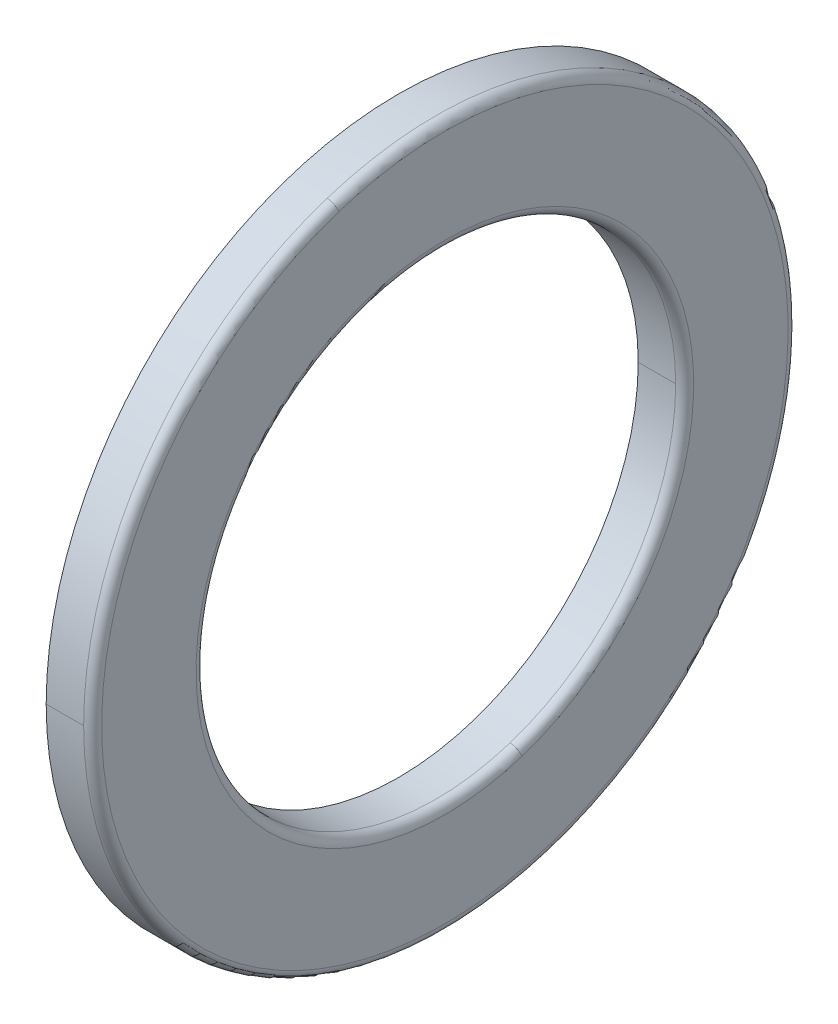
ISO-10303-21;
HEADER;
FILE_DESCRIPTION(('STEP AP214'),'2;1');
FILE_NAME('part.step','',(''),(''),'','','');
FILE_SCHEMA(('AUTOMOTIVE_DESIGN { 1 0 10303 214 1 1 1 1 }'));
ENDSEC;
DATA;
#1=APPLICATION_CONTEXT('core data for automotive mechanical design processes');
#2=APPLICATION_PROTOCOL_DEFINITION('international standard','automotive_design',2000,#1);
#3=PRODUCT_CONTEXT('',#1,'mechanical');
#4=PRODUCT('Part','Part','',(#3));
#5=PRODUCT_RELATED_PRODUCT_CATEGORY('part','',(#4));
#6=PRODUCT_DEFINITION_FORMATION('','',#4);
#7=PRODUCT_DEFINITION_CONTEXT('part definition',#1,'design');
#8=PRODUCT_DEFINITION('design','',#6,#7);
#9=PRODUCT_DEFINITION_SHAPE('','',#8);
#10=(LENGTH_UNIT() NAMED_UNIT(*) SI_UNIT(.MILLI.,.METRE.));
#11=(NAMED_UNIT(*) PLANE_ANGLE_UNIT() SI_UNIT($,.RADIAN.));
#12=(NAMED_UNIT(*) SI_UNIT($,.STERADIAN.) SOLID_ANGLE_UNIT());
#13=UNCERTAINTY_MEASURE_WITH_UNIT(LENGTH_MEASURE(1.E-05),#10,'distance_accuracy_value','');
#14=(GEOMETRIC_REPRESENTATION_CONTEXT(3) GLOBAL_UNCERTAINTY_ASSIGNED_CONTEXT((#13)) GLOBAL_UNIT_ASSIGNED_CONTEXT((#10,
#11,#12)) REPRESENTATION_CONTEXT('',''));
#15=CARTESIAN_POINT('',(0.,0.,0.));
#16=DIRECTION('',(0.,0.,1.));
#17=DIRECTION('',(1.,0.,0.));
#18=AXIS2_PLACEMENT_3D('',#15,#16,#17);
#19=CARTESIAN_POINT('',(5.5,0.,0.));
#20=DIRECTION('',(1.,0.,0.));
#21=DIRECTION('',(0.,-0.309016994374947,0.951056516295154));
#22=AXIS2_PLACEMENT_3D('',#19,#20,#21);
#23=TOROIDAL_SURFACE('',#22,19.25,3.);
#24=CARTESIAN_POINT('',(5.5,-18.3078379386817,-5.94857714171773));
#25=DIRECTION('',(0.,0.309016994374947,-0.951056516295154));
#26=DIRECTION('',(0.800000000000001,0.570633909777091,0.185410196624968));
#27=AXIS2_PLACEMENT_3D('',#24,#25,#26);
#28=CIRCLE('',#27,3.);
#29=CARTESIAN_POINT('',(7.9,-16.5959362093504,-5.39234655184283));
#30=VERTEX_POINT('',#29);
#31=CARTESIAN_POINT('',(7.9,-20.019739668013,-6.50480773159264));
#32=VERTEX_POINT('',#31);
#33=EDGE_CURVE('E11',#30,#32,#28,.T.);
#34=ORIENTED_EDGE('',*,*,#33,.F.);
#35=CARTESIAN_POINT('',(7.9,0.,0.));
#36=DIRECTION('',(1.,0.,0.));
#37=DIRECTION('',(0.,-0.951056516295154,-0.309016994374947));
#38=AXIS2_PLACEMENT_3D('',#35,#36,#37);
#39=CIRCLE('',#38,17.45);
#40=CARTESIAN_POINT('',(7.9,16.5959362093504,5.39234655184283));
#41=VERTEX_POINT('',#40);
#42=EDGE_CURVE('E25',#30,#41,#39,.T.);
#43=ORIENTED_EDGE('',*,*,#42,.T.);
#44=CARTESIAN_POINT('',(5.5,18.3078379386817,5.94857714171774));
#45=DIRECTION('',(0.,-0.309016994374947,0.951056516295154));
#46=DIRECTION('',(0.8,-0.570633909777092,-0.185410196624968));
#47=AXIS2_PLACEMENT_3D('',#44,#45,#46);
#48=CIRCLE('',#47,3.);
#49=CARTESIAN_POINT('',(7.9,20.019739668013,6.50480773159264));
#50=VERTEX_POINT('',#49);
#51=EDGE_CURVE('E327',#41,#50,#48,.T.);
#52=ORIENTED_EDGE('',*,*,#51,.T.);
#53=CARTESIAN_POINT('',(7.9,0.,0.));
#54=DIRECTION('',(1.,0.,0.));
#55=DIRECTION('',(0.,-0.951056516295154,-0.309016994374947));
#56=AXIS2_PLACEMENT_3D('',#53,#54,#55);
#57=CIRCLE('',#56,21.05);
#58=EDGE_CURVE('E323',#32,#50,#57,.T.);
#59=ORIENTED_EDGE('',*,*,#58,.F.);
#60=EDGE_LOOP('',(#34,#43,#52,#59));
#61=FACE_BOUND('',#60,.T.);
#62=ADVANCED_FACE('F17',(#61),#23,.F.);
#63=CARTESIAN_POINT('',(7.9,23.5,0.));
#64=DIRECTION('',(-1.,0.,0.));
#65=DIRECTION('',(0.,0.,1.));
#66=AXIS2_PLACEMENT_3D('',#63,#64,#65);
#67=PLANE('',#66);
#68=ORIENTED_EDGE('',*,*,#58,.T.);
#69=CARTESIAN_POINT('',(7.9,0.,0.));
#70=DIRECTION('',(1.,0.,0.));
#71=DIRECTION('',(0.,0.,-1.));
#72=AXIS2_PLACEMENT_3D('',#69,#70,#71);
#73=CIRCLE('',#72,21.05);
#74=EDGE_CURVE('E318',#50,#32,#73,.T.);
#75=ORIENTED_EDGE('',*,*,#74,.T.);
#76=EDGE_LOOP('',(#68,#75));
#77=FACE_BOUND('',#76,.T.);
#78=CARTESIAN_POINT('',(7.9,0.,0.));
#79=DIRECTION('',(1.,0.,0.));
#80=DIRECTION('',(0.,0.,-1.));
#81=AXIS2_PLACEMENT_3D('',#78,#79,#80);
#82=CIRCLE('',#81,23.5);
#83=CARTESIAN_POINT('',(7.9,0.,23.5));
#84=VERTEX_POINT('',#83);
#85=CARTESIAN_POINT('',(7.9,0.,-23.5));
#86=VERTEX_POINT('',#85);
#87=EDGE_CURVE('E313',#84,#86,#82,.T.);
#88=ORIENTED_EDGE('',*,*,#87,.F.);
#89=CARTESIAN_POINT('',(7.9,0.,0.));
#90=DIRECTION('',(1.,0.,0.));
#91=DIRECTION('',(0.,0.,-1.));
#92=AXIS2_PLACEMENT_3D('',#89,#90,#91);
#93=CIRCLE('',#92,23.5);
#94=EDGE_CURVE('E308',#86,#84,#93,.T.);
#95=ORIENTED_EDGE('',*,*,#94,.F.);
#96=EDGE_LOOP('',(#88,#95));
#97=FACE_BOUND('',#96,.T.);
#98=ADVANCED_FACE('F233',(#77,#97),#67,.T.);
#99=CARTESIAN_POINT('',(10.4,0.,0.));
#100=DIRECTION('',(1.,0.,0.));
#101=DIRECTION('',(0.,-1.,0.));
#102=AXIS2_PLACEMENT_3D('',#99,#100,#101);
#103=CYLINDRICAL_SURFACE('',#102,23.5);
#104=DIRECTION('',(1.,0.,0.));
#105=VECTOR('',#104,1.);
#106=CARTESIAN_POINT('',(7.9,0.,23.5));
#107=LINE('',#106,#105);
#108=CARTESIAN_POINT('',(10.4,0.,23.5));
#109=VERTEX_POINT('',#108);
#110=EDGE_CURVE('E304',#84,#109,#107,.T.);
#111=ORIENTED_EDGE('',*,*,#110,.T.);
#112=CARTESIAN_POINT('',(10.4,0.,0.));
#113=DIRECTION('',(1.,0.,0.));
#114=DIRECTION('',(0.,0.,-1.));
#115=AXIS2_PLACEMENT_3D('',#112,#113,#114);
#116=CIRCLE('',#115,23.5);
#117=CARTESIAN_POINT('',(10.4,22.3498281329361,7.26189936781126));
#118=VERTEX_POINT('',#117);
#119=EDGE_CURVE('E300',#118,#109,#116,.T.);
#120=ORIENTED_EDGE('',*,*,#119,.F.);
#121=CARTESIAN_POINT('',(10.4,0.,0.));
#122=DIRECTION('',(1.,0.,0.));
#123=DIRECTION('',(0.,0.,-1.));
#124=AXIS2_PLACEMENT_3D('',#121,#122,#123);
#125=CIRCLE('',#124,23.5);
#126=CARTESIAN_POINT('',(10.4,0.,-23.5));
#127=VERTEX_POINT('',#126);
#128=EDGE_CURVE('E296',#127,#118,#125,.T.);
#129=ORIENTED_EDGE('',*,*,#128,.F.);
#130=DIRECTION('',(1.,0.,0.));
#131=VECTOR('',#130,1.);
#132=CARTESIAN_POINT('',(7.9,0.,-23.5));
#133=LINE('',#132,#131);
#134=EDGE_CURVE('E291',#86,#127,#133,.T.);
#135=ORIENTED_EDGE('',*,*,#134,.F.);
#136=ORIENTED_EDGE('',*,*,#94,.T.);
#137=EDGE_LOOP('',(#111,#120,#129,#135,#136));
#138=FACE_BOUND('',#137,.T.);
#139=ADVANCED_FACE('F237',(#138),#103,.T.);
#140=CARTESIAN_POINT('',(10.4,0.,0.));
#141=DIRECTION('',(1.,0.,0.));
#142=DIRECTION('',(0.,1.,0.));
#143=AXIS2_PLACEMENT_3D('',#140,#141,#142);
#144=CYLINDRICAL_SURFACE('',#143,23.5);
#145=ORIENTED_EDGE('',*,*,#110,.F.);
#146=ORIENTED_EDGE('',*,*,#87,.T.);
#147=ORIENTED_EDGE('',*,*,#134,.T.);
#148=CARTESIAN_POINT('',(10.4,0.,0.));
#149=DIRECTION('',(1.,0.,0.));
#150=DIRECTION('',(0.,0.,-1.));
#151=AXIS2_PLACEMENT_3D('',#148,#149,#150);
#152=CIRCLE('',#151,23.5);
#153=CARTESIAN_POINT('',(10.4,-22.3498281329361,-7.26189936781126));
#154=VERTEX_POINT('',#153);
#155=EDGE_CURVE('E287',#154,#127,#152,.T.);
#156=ORIENTED_EDGE('',*,*,#155,.F.);
#157=CARTESIAN_POINT('',(10.4,0.,0.));
#158=DIRECTION('',(1.,0.,0.));
#159=DIRECTION('',(0.,0.,-1.));
#160=AXIS2_PLACEMENT_3D('',#157,#158,#159);
#161=CIRCLE('',#160,23.5);
#162=EDGE_CURVE('E266',#109,#154,#161,.T.);
#163=ORIENTED_EDGE('',*,*,#162,.F.);
#164=EDGE_LOOP('',(#145,#146,#147,#156,#163));
#165=FACE_BOUND('',#164,.T.);
#166=ADVANCED_FACE('F242',(#165),#144,.T.);
#167=CARTESIAN_POINT('',(10.4000000000002,0.,0.));
#168=DIRECTION('',(1.,0.,0.));
#169=DIRECTION('',(0.,0.309016994374947,-0.951056516295154));
#170=AXIS2_PLACEMENT_3D('',#167,#168,#169);
#171=TOROIDAL_SURFACE('',#170,22.9000000000003,0.599999999999748);
#172=CARTESIAN_POINT('',(10.4000000000002,-21.7791942231593,-7.07648917118637));
#173=DIRECTION('',(0.,0.309016994374947,-0.951056516295154));
#174=DIRECTION('',(1.,0.,0.));
#175=AXIS2_PLACEMENT_3D('',#172,#173,#174);
#176=CIRCLE('',#175,0.599999999999747);
#177=CARTESIAN_POINT('',(11.,-21.7791942231593,-7.07648917118637));
#178=VERTEX_POINT('',#177);
#179=EDGE_CURVE('E259',#178,#154,#176,.T.);
#180=ORIENTED_EDGE('',*,*,#179,.F.);
#181=CARTESIAN_POINT('',(11.,0.,0.));
#182=DIRECTION('',(1.,0.,0.));
#183=DIRECTION('',(0.,0.,-1.));
#184=AXIS2_PLACEMENT_3D('',#181,#182,#183);
#185=CIRCLE('',#184,22.9);
#186=CARTESIAN_POINT('',(11.,21.7791942231593,7.07648917118637));
#187=VERTEX_POINT('',#186);
#188=EDGE_CURVE('E262',#187,#178,#185,.T.);
#189=ORIENTED_EDGE('',*,*,#188,.F.);
#190=CARTESIAN_POINT('',(10.4000000000002,21.7791942231593,7.07648917118637));
#191=DIRECTION('',(0.,-0.309016994374947,0.951056516295154));
#192=DIRECTION('',(1.,0.,0.));
#193=AXIS2_PLACEMENT_3D('',#190,#191,#192);
#194=CIRCLE('',#193,0.599999999999747);
#195=EDGE_CURVE('E271',#187,#118,#194,.T.);
#196=ORIENTED_EDGE('',*,*,#195,.T.);
#197=ORIENTED_EDGE('',*,*,#119,.T.);
#198=ORIENTED_EDGE('',*,*,#162,.T.);
#199=EDGE_LOOP('',(#180,#189,#196,#197,#198));
#200=FACE_BOUND('',#199,.T.);
#201=ADVANCED_FACE('F249',(#200),#171,.T.);
#202=CARTESIAN_POINT('',(10.4000000000002,0.,0.));
#203=DIRECTION('',(1.,0.,0.));
#204=DIRECTION('',(0.,-0.309016994374947,0.951056516295154));
#205=AXIS2_PLACEMENT_3D('',#202,#203,#204);
#206=TOROIDAL_SURFACE('',#205,22.9000000000003,0.599999999999748);
#207=ORIENTED_EDGE('',*,*,#179,.T.);
#208=ORIENTED_EDGE('',*,*,#155,.T.);
#209=ORIENTED_EDGE('',*,*,#128,.T.);
#210=ORIENTED_EDGE('',*,*,#195,.F.);
#211=CARTESIAN_POINT('',(11.,-21.779194223159,-7.07648917118629));
#212=CARTESIAN_POINT('',(11.,-20.6675767557073,-10.497524989855));
#213=CARTESIAN_POINT('',(11.,-18.8845171401787,-13.7005026982399));
#214=CARTESIAN_POINT('',(11.,-16.4859366746272,-16.5087282472489));
#215=CARTESIAN_POINT('',(11.,-10.716969966334,-21.0332298184904));
#216=CARTESIAN_POINT('',(11.,-3.66565316884742,-23.0410097314247));
#217=CARTESIAN_POINT('',(11.,0.016116955726321,-23.3307776027427));
#218=CARTESIAN_POINT('',(11.,7.29469581034565,-22.4507652042022));
#219=CARTESIAN_POINT('',(11.,13.7004481083275,-18.884468881489));
#220=CARTESIAN_POINT('',(11.,16.5087414271407,-16.4859515676135));
#221=CARTESIAN_POINT('',(11.,21.0332331263571,-10.7169634742802));
#222=CARTESIAN_POINT('',(11.,23.0409899357996,-3.66565125996869));
#223=CARTESIAN_POINT('',(11.,23.3308487319883,0.0161011573056626));
#224=CARTESIAN_POINT('',(11.,22.8907112025243,3.65542070195902));
#225=CARTESIAN_POINT('',(11.,21.779194223159,7.07648917118629));
#226=B_SPLINE_CURVE_WITH_KNOTS('',5,(#211,#212,#213,#214,#215,#216,#217,#218,#219,#220,#221,
#222,#223,#224,#225),.UNSPECIFIED.,.F.,.F.,(6,3,3,3,6),(0.,0.785398163397448,1.5707963267949,
2.35619449019234,3.14159265358979),.UNSPECIFIED.);
#227=EDGE_CURVE('E205',#178,#187,#226,.T.);
#228=ORIENTED_EDGE('',*,*,#227,.F.);
#229=EDGE_LOOP('',(#207,#208,#209,#210,#228));
#230=FACE_BOUND('',#229,.T.);
#231=ADVANCED_FACE('F167',(#230),#206,.T.);
#232=CARTESIAN_POINT('',(11.,16.6,0.));
#233=DIRECTION('',(1.,0.,0.));
#234=DIRECTION('',(0.,0.,-1.));
#235=AXIS2_PLACEMENT_3D('',#232,#233,#234);
#236=PLANE('',#235);
#237=ORIENTED_EDGE('',*,*,#227,.T.);
#238=ORIENTED_EDGE('',*,*,#188,.T.);
#239=EDGE_LOOP('',(#237,#238));
#240=FACE_BOUND('',#239,.T.);
#241=CARTESIAN_POINT('',(11.,15.7875381704993,5.12968210662408));
#242=CARTESIAN_POINT('',(11.,15.7036093382217,5.38800713718692));
#243=CARTESIAN_POINT('',(11.,15.6133296931235,5.64426814808535));
#244=CARTESIAN_POINT('',(11.,15.4203099435753,6.15205377442434));
#245=CARTESIAN_POINT('',(11.,15.3175698391254,6.40357838986492));
#246=CARTESIAN_POINT('',(11.,15.0998703371631,6.90128286915921));
#247=CARTESIAN_POINT('',(11.,14.9849109396507,7.14746273301294));
#248=CARTESIAN_POINT('',(11.,14.7430514985896,7.63388528638444));
#249=CARTESIAN_POINT('',(11.,14.6161514550409,7.87412797590221));
#250=CARTESIAN_POINT('',(11.,14.3507159797756,8.34809724179649));
#251=CARTESIAN_POINT('',(11.,14.212180548059,8.58182381817299));
#252=CARTESIAN_POINT('',(11.,13.9238081624852,9.0421978363785));
#253=CARTESIAN_POINT('',(11.,13.7739712086279,9.26884527820751));
#254=CARTESIAN_POINT('',(11.,13.4633567164187,9.71451500134898));
#255=CARTESIAN_POINT('',(11.,13.3025791780668,9.93353728266144));
#256=CARTESIAN_POINT('',(11.,12.9704708528027,10.3634290442406));
#257=CARTESIAN_POINT('',(11.,12.7991400658904,10.5742985245073));
#258=CARTESIAN_POINT('',(11.,12.4463379920302,10.9873766800545));
#259=CARTESIAN_POINT('',(11.,12.2648667050823,11.1895853553351));
#260=CARTESIAN_POINT('',(11.,11.8922208120052,11.584854762739));
#261=CARTESIAN_POINT('',(11.,11.701046205876,11.7779154948624));
#262=CARTESIAN_POINT('',(11.,11.3094542306388,12.1544239156742));
#263=CARTESIAN_POINT('',(11.,11.1090368615308,12.3378716043625));
#264=CARTESIAN_POINT('',(11.,10.6994421833778,12.6947119967712));
#265=CARTESIAN_POINT('',(11.,10.4902648743329,12.8681047004915));
#266=CARTESIAN_POINT('',(11.,10.0636542427532,13.2044174047489));
#267=CARTESIAN_POINT('',(11.,9.84622092021852,13.3673374052859));
#268=CARTESIAN_POINT('',(11.,9.40362207758142,13.6823122146264));
#269=CARTESIAN_POINT('',(11.,9.17845655747904,13.8343670234299));
#270=CARTESIAN_POINT('',(11.,8.72093576316587,14.1272451359504));
#271=CARTESIAN_POINT('',(11.,8.48858048895507,14.2680684396673));
#272=CARTESIAN_POINT('',(11.,8.01723995063278,14.5381442863412));
#273=CARTESIAN_POINT('',(11.,7.77825468652128,14.6673968292982));
#274=CARTESIAN_POINT('',(11.,7.29422990483141,14.9140197737552));
#275=CARTESIAN_POINT('',(11.,7.04919038725304,15.0313901752551));
#276=CARTESIAN_POINT('',(11.,6.55364742029021,15.2539660812203));
#277=CARTESIAN_POINT('',(11.,6.30314397090575,15.3591715856856));
#278=CARTESIAN_POINT('',(11.,5.79727662508181,15.5571642483062));
#279=CARTESIAN_POINT('',(11.,5.54191272864233,15.6499514064616));
#280=CARTESIAN_POINT('',(11.,5.02693968270213,15.8228838440713));
#281=CARTESIAN_POINT('',(11.,4.7673305332014,15.9030291235256));
#282=CARTESIAN_POINT('',(11.,4.2444924023189,16.050484726735));
#283=CARTESIAN_POINT('',(11.,3.98126342093714,16.1177950504902));
#284=CARTESIAN_POINT('',(11.,3.45181976796486,16.2394185858357));
#285=CARTESIAN_POINT('',(11.,3.18560509637435,16.293731797426));
#286=CARTESIAN_POINT('',(11.,2.65083139744609,16.3892302631579));
#287=CARTESIAN_POINT('',(11.,2.38227237010834,16.4304155172995));
#288=CARTESIAN_POINT('',(11.,1.84345694190547,16.4995588492492));
#289=CARTESIAN_POINT('',(11.,1.57320054104034,16.5275169270574));
#290=CARTESIAN_POINT('',(11.,1.03164143712404,16.570138552882));
#291=CARTESIAN_POINT('',(11.,0.76033873407287,16.5848021008985));
#292=CARTESIAN_POINT('',(11.,0.217340617759459,16.6007993413682));
#293=CARTESIAN_POINT('',(11.,-0.0543547955027848,16.6021330338214));
#294=CARTESIAN_POINT('',(11.,-0.597483794190092,16.5914673501827));
#295=CARTESIAN_POINT('',(11.,-0.868917379615156,16.5794679740907));
#296=CARTESIAN_POINT('',(11.,-1.41086881534604,16.5421650609097));
#297=CARTESIAN_POINT('',(11.,-1.68138666565186,16.5168615238206));
#298=CARTESIAN_POINT('',(11.,-2.22085492994831,16.4530112470825));
#299=CARTESIAN_POINT('',(11.,-2.48980534393893,16.4144645074334));
#300=CARTESIAN_POINT('',(11.,-3.02549081050041,16.3242206880474));
#301=CARTESIAN_POINT('',(11.,-3.29222586307127,16.2725236083105));
#302=CARTESIAN_POINT('',(11.,-3.82283801868833,16.156103651542));
#303=CARTESIAN_POINT('',(11.,-4.08671512173454,16.0913807745104));
#304=CARTESIAN_POINT('',(11.,-4.61097567524816,15.9490651462325));
#305=CARTESIAN_POINT('',(11.,-4.87135912571557,15.8714723949861));
#306=CARTESIAN_POINT('',(11.,-5.38800508753254,15.7036039460125));
#307=CARTESIAN_POINT('',(11.,-5.6442675988821,15.6133282482854));
#308=CARTESIAN_POINT('',(11.,-6.15205432362756,15.4203113884134));
#309=CARTESIAN_POINT('',(11.,-6.40357853702346,15.3175702262686));
#310=CARTESIAN_POINT('',(11.,-6.90128272200063,15.0998699500199));
#311=CARTESIAN_POINT('',(11.,-7.1474626935819,14.984910835916));
#312=CARTESIAN_POINT('',(11.,-7.63388532581543,14.7430516023243));
#313=CARTESIAN_POINT('',(11.,-7.8741279864677,14.6161514828365));
#314=CARTESIAN_POINT('',(11.,-8.34809723123096,14.3507159519799));
#315=CARTESIAN_POINT('',(11.,-8.58182381534194,14.2121805406112));
#316=CARTESIAN_POINT('',(11.,-9.04219783920949,13.923808169933));
#317=CARTESIAN_POINT('',(11.,-9.26884527896605,13.7739712106235));
#318=CARTESIAN_POINT('',(11.,-9.71451500059039,13.4633567144231));
#319=CARTESIAN_POINT('',(11.,-9.93353728245817,13.3025791775321));
#320=CARTESIAN_POINT('',(11.,-10.3634290444438,12.9704708533374));
#321=CARTESIAN_POINT('',(11.,-10.5742985245617,12.7991400660337));
#322=CARTESIAN_POINT('',(11.,-10.98737668,12.446337991887));
#323=CARTESIAN_POINT('',(11.,-11.1895853553205,12.2648667050439));
#324=CARTESIAN_POINT('',(11.,-11.5848547627536,11.8922208120436));
#325=CARTESIAN_POINT('',(11.,-11.7779154948663,11.7010462058863));
#326=CARTESIAN_POINT('',(11.,-12.1544239156702,11.3094542306285));
#327=CARTESIAN_POINT('',(11.,-12.3378716043615,11.109036861528));
#328=CARTESIAN_POINT('',(11.,-12.6947119967722,10.6994421833806));
#329=CARTESIAN_POINT('',(11.,-12.8681047004918,10.4902648743337));
#330=CARTESIAN_POINT('',(11.,-13.2044174047486,10.0636542427525));
#331=CARTESIAN_POINT('',(11.,-13.3673374052858,9.84622092021834));
#332=CARTESIAN_POINT('',(11.,-13.6823122146265,9.40362207758164));
#333=CARTESIAN_POINT('',(11.,-13.8343670234299,9.17845655747911));
#334=CARTESIAN_POINT('',(11.,-14.1272451359503,8.72093576316583));
#335=CARTESIAN_POINT('',(11.,-14.2680684396673,8.48858048895507));
#336=CARTESIAN_POINT('',(11.,-14.5381442863412,8.01723995063281));
#337=CARTESIAN_POINT('',(11.,-14.6673968292982,7.7782546865213));
#338=CARTESIAN_POINT('',(11.,-14.9140197737552,7.29422990483143));
#339=CARTESIAN_POINT('',(11.,-15.0313901752551,7.04919038725306));
#340=CARTESIAN_POINT('',(11.,-15.2539660812204,6.55364742029023));
#341=CARTESIAN_POINT('',(11.,-15.3591715856856,6.30314397090576));
#342=CARTESIAN_POINT('',(11.,-15.5571642483062,5.79727662508185));
#343=CARTESIAN_POINT('',(11.,-15.6499514064614,5.54191272864242));
#344=CARTESIAN_POINT('',(11.,-15.8228838440715,5.0269396827021));
#345=CARTESIAN_POINT('',(11.,-15.9030291235263,4.76733053320121));
#346=CARTESIAN_POINT('',(11.,-16.0504847267343,4.24449240231913));
#347=CARTESIAN_POINT('',(11.,-16.1177950504873,3.98126342093793));
#348=CARTESIAN_POINT('',(11.,-16.2394185858385,3.45181976796411));
#349=CARTESIAN_POINT('',(11.,-16.2937317974366,3.18560509637149));
#350=CARTESIAN_POINT('',(11.,-16.3892302631473,2.650831397449));
#351=CARTESIAN_POINT('',(11.,-16.4304155172598,2.38227237011913));
#352=CARTESIAN_POINT('',(11.,-16.4995588492888,1.84345694189474));
#353=CARTESIAN_POINT('',(11.,-16.5275169272053,1.57320054100021));
#354=CARTESIAN_POINT('',(11.,-16.5701385527341,1.03164143716422));
#355=CARTESIAN_POINT('',(11.,-16.5848021003464,0.760338734222767));
#356=CARTESIAN_POINT('',(11.,-16.6007993419202,0.217340617609622));
#357=CARTESIAN_POINT('',(11.,-16.6021330358818,-0.0543547960620649));
#358=CARTESIAN_POINT('',(11.,-16.5914673481223,-0.597483793630752));
#359=CARTESIAN_POINT('',(11.,-16.5794679664013,-0.868917377527752));
#360=CARTESIAN_POINT('',(11.,-16.5421650685991,-1.41086881743339));
#361=CARTESIAN_POINT('',(11.,-16.516861552518,-1.68138667344203));
#362=CARTESIAN_POINT('',(11.,-16.4530112183851,-2.22085492215811));
#363=CARTESIAN_POINT('',(11.,-16.4144644003333,-2.48980531486555));
#364=CARTESIAN_POINT('',(11.,-16.3242207951475,-3.02549083957376));
#365=CARTESIAN_POINT('',(11.,-16.2725240080135,-3.29222597157453));
#366=CARTESIAN_POINT('',(11.,-16.1561032518389,-3.82283791018502));
#367=CARTESIAN_POINT('',(11.,-16.0913792827983,-4.08671471679474));
#368=CARTESIAN_POINT('',(11.,-15.9490666379446,-4.6109760801879));
#369=CARTESIAN_POINT('',(11.,-15.8714779621315,-4.87136063697134));
#370=CARTESIAN_POINT('',(11.,-15.7875381704993,-5.12968210662403));
#371=B_SPLINE_CURVE_WITH_KNOTS('',3,(#241,#242,#243,#244,#245,#246,#247,#248,#249,#250,#251,
#252,#253,#254,#255,#256,#257,#258,#259,#260,#261,#262,#263,#264,#265,#266,#267,#268,#269,#270,
#271,#272,#273,#274,#275,#276,#277,#278,#279,#280,#281,#282,#283,#284,#285,#286,#287,#288,#289,
#290,#291,#292,#293,#294,#295,#296,#297,#298,#299,#300,#301,#302,#303,#304,#305,#306,#307,#308,
#309,#310,#311,#312,#313,#314,#315,#316,#317,#318,#319,#320,#321,#322,#323,#324,#325,#326,#327,
#328,#329,#330,#331,#332,#333,#334,#335,#336,#337,#338,#339,#340,#341,#342,#343,#344,#345,#346,
#347,#348,#349,#350,#351,#352,#353,#354,#355,#356,#357,#358,#359,#360,#361,#362,#363,#364,#365,
#366,#367,#368,#369,#370),.UNSPECIFIED.,.F.,.F.,(4,2,2,2,2,2,2,2,2,2,2,2,2,2,2,2,2,2,2,2,2,2,2,
2,2,2,2,2,2,2,2,2,2,2,2,2,2,2,2,2,2,2,2,2,2,2,2,2,2,2,2,2,2,2,2,2,2,2,2,2,2,2,2,2,4),(0.,
0.814768786960672,1.62953757392135,2.44430636088202,3.2590751478427,4.07384393480337,
4.88861272176405,5.70338150872472,6.5181502956854,7.33291908264607,8.14768786960675,
8.96245665656743,9.7772254435281,10.5919942304888,11.4067630174494,12.2215318044101,
13.0363005913708,13.8510693783315,14.6658381652922,15.4806069522528,16.2953757392135,
17.1101445261742,17.9249133131349,18.7396821000955,19.5544508870562,20.3692196740169,
21.1839884609776,21.9987572479382,22.8135260348989,23.6282948218596,24.4430636088203,
25.2578323957809,26.0726011827416,26.8873699697023,27.702138756663,28.5169075436236,
29.3316763305843,30.146445117545,30.9612139045057,31.7759826914663,32.590751478427,
33.4055202653877,34.2202890523483,35.035057839309,35.8498266262697,36.6645954132304,
37.479364200191,38.2941329871517,39.1089017741124,39.9236705610731,40.7384393480338,
41.5532081349944,42.3679769219551,43.1827457089158,43.9975144958765,44.8122832828371,
45.6270520697978,46.4418208567585,47.2565896437191,48.0713584306798,48.8861272176405,
49.7008960046012,50.5156647915618,51.3304335785225,52.1452023654832),.UNSPECIFIED.);
#372=CARTESIAN_POINT('',(11.,15.7875381704993,5.12968210662405));
#373=VERTEX_POINT('',#372);
#374=CARTESIAN_POINT('',(11.,-15.7875381704993,-5.12968210662405));
#375=VERTEX_POINT('',#374);
#376=EDGE_CURVE('E201',#373,#375,#371,.T.);
#377=ORIENTED_EDGE('',*,*,#376,.F.);
#378=CARTESIAN_POINT('',(11.,-15.7875381704993,-5.12968210662408));
#379=CARTESIAN_POINT('',(11.,-15.7036093382217,-5.38800713718692));
#380=CARTESIAN_POINT('',(11.,-15.6133296931235,-5.64426814808535));
#381=CARTESIAN_POINT('',(11.,-15.4203099435753,-6.15205377442434));
#382=CARTESIAN_POINT('',(11.,-15.3175698391254,-6.40357838986492));
#383=CARTESIAN_POINT('',(11.,-15.0998703371631,-6.90128286915921));
#384=CARTESIAN_POINT('',(11.,-14.9849109396507,-7.14746273301293));
#385=CARTESIAN_POINT('',(11.,-14.7430514985896,-7.63388528638443));
#386=CARTESIAN_POINT('',(11.,-14.6161514550409,-7.87412797590221));
#387=CARTESIAN_POINT('',(11.,-14.3507159797756,-8.34809724179649));
#388=CARTESIAN_POINT('',(11.,-14.212180548059,-8.58182381817299));
#389=CARTESIAN_POINT('',(11.,-13.9238081624852,-9.04219783637849));
#390=CARTESIAN_POINT('',(11.,-13.7739712086279,-9.2688452782075));
#391=CARTESIAN_POINT('',(11.,-13.4633567164187,-9.71451500134897));
#392=CARTESIAN_POINT('',(11.,-13.3025791780668,-9.93353728266144));
#393=CARTESIAN_POINT('',(11.,-12.9704708528027,-10.3634290442406));
#394=CARTESIAN_POINT('',(11.,-12.7991400658904,-10.5742985245073));
#395=CARTESIAN_POINT('',(11.,-12.4463379920302,-10.9873766800545));
#396=CARTESIAN_POINT('',(11.,-12.2648667050823,-11.1895853553351));
#397=CARTESIAN_POINT('',(11.,-11.8922208120052,-11.584854762739));
#398=CARTESIAN_POINT('',(11.,-11.701046205876,-11.7779154948624));
#399=CARTESIAN_POINT('',(11.,-11.3094542306388,-12.1544239156742));
#400=CARTESIAN_POINT('',(11.,-11.1090368615308,-12.3378716043625));
#401=CARTESIAN_POINT('',(11.,-10.6994421833778,-12.6947119967712));
#402=CARTESIAN_POINT('',(11.,-10.4902648743329,-12.8681047004915));
#403=CARTESIAN_POINT('',(11.,-10.0636542427532,-13.2044174047488));
#404=CARTESIAN_POINT('',(11.,-9.84622092021852,-13.3673374052859));
#405=CARTESIAN_POINT('',(11.,-9.40362207758142,-13.6823122146264));
#406=CARTESIAN_POINT('',(11.,-9.17845655747905,-13.8343670234299));
#407=CARTESIAN_POINT('',(11.,-8.72093576316587,-14.1272451359504));
#408=CARTESIAN_POINT('',(11.,-8.48858048895508,-14.2680684396673));
#409=CARTESIAN_POINT('',(11.,-8.01723995063278,-14.5381442863412));
#410=CARTESIAN_POINT('',(11.,-7.77825468652129,-14.6673968292982));
#411=CARTESIAN_POINT('',(11.,-7.29422990483142,-14.9140197737552));
#412=CARTESIAN_POINT('',(11.,-7.04919038725305,-15.0313901752551));
#413=CARTESIAN_POINT('',(11.,-6.55364742029022,-15.2539660812203));
#414=CARTESIAN_POINT('',(11.,-6.30314397090576,-15.3591715856856));
#415=CARTESIAN_POINT('',(11.,-5.79727662508182,-15.5571642483062));
#416=CARTESIAN_POINT('',(11.,-5.54191272864235,-15.6499514064616));
#417=CARTESIAN_POINT('',(11.,-5.02693968270214,-15.8228838440713));
#418=CARTESIAN_POINT('',(11.,-4.76733053320141,-15.9030291235256));
#419=CARTESIAN_POINT('',(11.,-4.24449240231892,-16.050484726735));
#420=CARTESIAN_POINT('',(11.,-3.98126342093716,-16.1177950504902));
#421=CARTESIAN_POINT('',(11.,-3.45181976796488,-16.2394185858356));
#422=CARTESIAN_POINT('',(11.,-3.18560509637438,-16.293731797426));
#423=CARTESIAN_POINT('',(11.,-2.65083139744612,-16.3892302631579));
#424=CARTESIAN_POINT('',(11.,-2.38227237010837,-16.4304155172995));
#425=CARTESIAN_POINT('',(11.,-1.8434569419055,-16.4995588492492));
#426=CARTESIAN_POINT('',(11.,-1.57320054104036,-16.5275169270574));
#427=CARTESIAN_POINT('',(11.,-1.03164143712406,-16.570138552882));
#428=CARTESIAN_POINT('',(11.,-0.760338734072889,-16.5848021008985));
#429=CARTESIAN_POINT('',(11.,-0.217340617759477,-16.6007993413682));
#430=CARTESIAN_POINT('',(11.,0.0543547955027643,-16.6021330338214));
#431=CARTESIAN_POINT('',(11.,0.597483794190072,-16.5914673501827));
#432=CARTESIAN_POINT('',(11.,0.868917379615138,-16.5794679740907));
#433=CARTESIAN_POINT('',(11.,1.41086881534602,-16.5421650609097));
#434=CARTESIAN_POINT('',(11.,1.68138666565184,-16.5168615238206));
#435=CARTESIAN_POINT('',(11.,2.22085492994828,-16.4530112470825));
#436=CARTESIAN_POINT('',(11.,2.48980534393891,-16.4144645074334));
#437=CARTESIAN_POINT('',(11.,3.02549081050039,-16.3242206880474));
#438=CARTESIAN_POINT('',(11.,3.29222586307124,-16.2725236083105));
#439=CARTESIAN_POINT('',(11.,3.82283801868831,-16.156103651542));
#440=CARTESIAN_POINT('',(11.,4.08671512173451,-16.0913807745104));
#441=CARTESIAN_POINT('',(11.,4.61097567524813,-15.9490651462325));
#442=CARTESIAN_POINT('',(11.,4.87135912571555,-15.8714723949861));
#443=CARTESIAN_POINT('',(11.,5.38800508753252,-15.7036039460126));
#444=CARTESIAN_POINT('',(11.,5.64426759888207,-15.6133282482854));
#445=CARTESIAN_POINT('',(11.,6.15205432362753,-15.4203113884134));
#446=CARTESIAN_POINT('',(11.,6.40357853702344,-15.3175702262686));
#447=CARTESIAN_POINT('',(11.,6.90128272200061,-15.0998699500199));
#448=CARTESIAN_POINT('',(11.,7.14746269358188,-14.984910835916));
#449=CARTESIAN_POINT('',(11.,7.63388532581541,-14.7430516023243));
#450=CARTESIAN_POINT('',(11.,7.87412798646768,-14.6161514828365));
#451=CARTESIAN_POINT('',(11.,8.34809723123094,-14.3507159519799));
#452=CARTESIAN_POINT('',(11.,8.58182381534193,-14.2121805406112));
#453=CARTESIAN_POINT('',(11.,9.04219783920948,-13.923808169933));
#454=CARTESIAN_POINT('',(11.,9.26884527896603,-13.7739712106236));
#455=CARTESIAN_POINT('',(11.,9.71451500059037,-13.4633567144231));
#456=CARTESIAN_POINT('',(11.,9.93353728245815,-13.3025791775321));
#457=CARTESIAN_POINT('',(11.,10.3634290444438,-12.9704708533374));
#458=CARTESIAN_POINT('',(11.,10.5742985245617,-12.7991400660337));
#459=CARTESIAN_POINT('',(11.,10.98737668,-12.446337991887));
#460=CARTESIAN_POINT('',(11.,11.1895853553204,-12.2648667050439));
#461=CARTESIAN_POINT('',(11.,11.5848547627536,-11.8922208120436));
#462=CARTESIAN_POINT('',(11.,11.7779154948663,-11.7010462058863));
#463=CARTESIAN_POINT('',(11.,12.1544239156702,-11.3094542306285));
#464=CARTESIAN_POINT('',(11.,12.3378716043614,-11.1090368615281));
#465=CARTESIAN_POINT('',(11.,12.6947119967722,-10.6994421833806));
#466=CARTESIAN_POINT('',(11.,12.8681047004918,-10.4902648743337));
#467=CARTESIAN_POINT('',(11.,13.2044174047485,-10.0636542427526));
#468=CARTESIAN_POINT('',(11.,13.3673374052857,-9.84622092021837));
#469=CARTESIAN_POINT('',(11.,13.6823122146264,-9.40362207758166));
#470=CARTESIAN_POINT('',(11.,13.8343670234299,-9.17845655747915));
#471=CARTESIAN_POINT('',(11.,14.1272451359503,-8.72093576316587));
#472=CARTESIAN_POINT('',(11.,14.2680684396672,-8.48858048895511));
#473=CARTESIAN_POINT('',(11.,14.5381442863412,-8.01723995063285));
#474=CARTESIAN_POINT('',(11.,14.6673968292982,-7.77825468652134));
#475=CARTESIAN_POINT('',(11.,14.9140197737552,-7.29422990483146));
#476=CARTESIAN_POINT('',(11.,15.0313901752551,-7.0491903872531));
#477=CARTESIAN_POINT('',(11.,15.2539660812203,-6.55364742029026));
#478=CARTESIAN_POINT('',(11.,15.3591715856856,-6.30314397090578));
#479=CARTESIAN_POINT('',(11.,15.5571642483062,-5.79727662508188));
#480=CARTESIAN_POINT('',(11.,15.6499514064614,-5.54191272864244));
#481=CARTESIAN_POINT('',(11.,15.8228838440715,-5.02693968270213));
#482=CARTESIAN_POINT('',(11.,15.9030291235263,-4.76733053320125));
#483=CARTESIAN_POINT('',(11.,16.0504847267343,-4.24449240231917));
#484=CARTESIAN_POINT('',(11.,16.1177950504873,-3.98126342093797));
#485=CARTESIAN_POINT('',(11.,16.2394185858385,-3.45181976796416));
#486=CARTESIAN_POINT('',(11.,16.2937317974366,-3.18560509637154));
#487=CARTESIAN_POINT('',(11.,16.3892302631473,-2.65083139744905));
#488=CARTESIAN_POINT('',(11.,16.4304155172598,-2.38227237011918));
#489=CARTESIAN_POINT('',(11.,16.4995588492888,-1.84345694189478));
#490=CARTESIAN_POINT('',(11.,16.5275169272053,-1.57320054100026));
#491=CARTESIAN_POINT('',(11.,16.5701385527341,-1.03164143716427));
#492=CARTESIAN_POINT('',(11.,16.5848021003464,-0.760338734222813));
#493=CARTESIAN_POINT('',(11.,16.6007993419202,-0.217340617609668));
#494=CARTESIAN_POINT('',(11.,16.6021330358818,0.0543547960620186));
#495=CARTESIAN_POINT('',(11.,16.5914673481223,0.597483793630706));
#496=CARTESIAN_POINT('',(11.,16.5794679664013,0.868917377527706));
#497=CARTESIAN_POINT('',(11.,16.5421650685991,1.41086881743334));
#498=CARTESIAN_POINT('',(11.,16.516861552518,1.68138667344198));
#499=CARTESIAN_POINT('',(11.,16.4530112183851,2.22085492215806));
#500=CARTESIAN_POINT('',(11.,16.4144644003333,2.4898053148655));
#501=CARTESIAN_POINT('',(11.,16.3242207951475,3.02549083957372));
#502=CARTESIAN_POINT('',(11.,16.2725240080136,3.29222597157449));
#503=CARTESIAN_POINT('',(11.,16.1561032518389,3.82283791018498));
#504=CARTESIAN_POINT('',(11.,16.0913792827983,4.0867147167947));
#505=CARTESIAN_POINT('',(11.,15.9490666379446,4.61097608018786));
#506=CARTESIAN_POINT('',(11.,15.8714779621315,4.8713606369713));
#507=CARTESIAN_POINT('',(11.,15.7875381704993,5.12968210662399));
#508=B_SPLINE_CURVE_WITH_KNOTS('',3,(#378,#379,#380,#381,#382,#383,#384,#385,#386,#387,#388,
#389,#390,#391,#392,#393,#394,#395,#396,#397,#398,#399,#400,#401,#402,#403,#404,#405,#406,#407,
#408,#409,#410,#411,#412,#413,#414,#415,#416,#417,#418,#419,#420,#421,#422,#423,#424,#425,#426,
#427,#428,#429,#430,#431,#432,#433,#434,#435,#436,#437,#438,#439,#440,#441,#442,#443,#444,#445,
#446,#447,#448,#449,#450,#451,#452,#453,#454,#455,#456,#457,#458,#459,#460,#461,#462,#463,#464,
#465,#466,#467,#468,#469,#470,#471,#472,#473,#474,#475,#476,#477,#478,#479,#480,#481,#482,#483,
#484,#485,#486,#487,#488,#489,#490,#491,#492,#493,#494,#495,#496,#497,#498,#499,#500,#501,#502,
#503,#504,#505,#506,#507),.UNSPECIFIED.,.F.,.F.,(4,2,2,2,2,2,2,2,2,2,2,2,2,2,2,2,2,2,2,2,2,2,2,
2,2,2,2,2,2,2,2,2,2,2,2,2,2,2,2,2,2,2,2,2,2,2,2,2,2,2,2,2,2,2,2,2,2,2,2,2,2,2,2,2,4),(0.,
0.814768786960672,1.62953757392135,2.44430636088202,3.25907514784269,4.07384393480337,
4.88861272176404,5.70338150872472,6.51815029568539,7.33291908264607,8.14768786960674,
8.96245665656741,9.77722544352809,10.5919942304888,11.4067630174494,12.2215318044101,
13.0363005913708,13.8510693783315,14.6658381652921,15.4806069522528,16.2953757392135,
17.1101445261742,17.9249133131348,18.7396821000955,19.5544508870562,20.3692196740169,
21.1839884609775,21.9987572479382,22.8135260348989,23.6282948218596,24.4430636088202,
25.2578323957809,26.0726011827416,26.8873699697023,27.7021387566629,28.5169075436236,
29.3316763305843,30.146445117545,30.9612139045056,31.7759826914663,32.590751478427,
33.4055202653877,34.2202890523483,35.035057839309,35.8498266262697,36.6645954132303,
37.479364200191,38.2941329871517,39.1089017741124,39.923670561073,40.7384393480337,
41.5532081349944,42.3679769219551,43.1827457089157,43.9975144958764,44.8122832828371,
45.6270520697978,46.4418208567584,47.2565896437191,48.0713584306798,48.8861272176405,
49.7008960046011,50.5156647915618,51.3304335785225,52.1452023654831),.UNSPECIFIED.);
#509=EDGE_CURVE('E191',#375,#373,#508,.T.);
#510=ORIENTED_EDGE('',*,*,#509,.F.);
#511=EDGE_LOOP('',(#377,#510));
#512=FACE_BOUND('',#511,.T.);
#513=ADVANCED_FACE('F161',(#240,#512),#236,.T.);
#514=CARTESIAN_POINT('',(10.4000000000002,0.,0.));
#515=DIRECTION('',(1.,0.,0.));
#516=DIRECTION('',(0.,-0.309016994374947,0.951056516295154));
#517=AXIS2_PLACEMENT_3D('',#514,#515,#516);
#518=TOROIDAL_SURFACE('',#517,16.5999999999997,0.59999999999975);
#519=CARTESIAN_POINT('',(10.4000000000002,-15.7875381704993,-5.12968210662405));
#520=DIRECTION('',(0.,0.309016994374947,-0.951056516295154));
#521=DIRECTION('',(-3.99680288865223E-13,0.951056516295154,0.309016994374947));
#522=AXIS2_PLACEMENT_3D('',#519,#520,#521);
#523=CIRCLE('',#522,0.599999999999749);
#524=CARTESIAN_POINT('',(10.4,-15.2169042607225,-4.94427190999916));
#525=VERTEX_POINT('',#524);
#526=EDGE_CURVE('E142',#525,#375,#523,.T.);
#527=ORIENTED_EDGE('',*,*,#526,.T.);
#528=ORIENTED_EDGE('',*,*,#509,.T.);
#529=CARTESIAN_POINT('',(10.4000000000002,15.7875381704993,5.12968210662405));
#530=DIRECTION('',(0.,-0.309016994374947,0.951056516295154));
#531=DIRECTION('',(-3.99680288865223E-13,-0.951056516295154,-0.309016994374947));
#532=AXIS2_PLACEMENT_3D('',#529,#530,#531);
#533=CIRCLE('',#532,0.599999999999749);
#534=CARTESIAN_POINT('',(10.4,15.2169042607225,4.94427190999916));
#535=VERTEX_POINT('',#534);
#536=EDGE_CURVE('E137',#535,#373,#533,.T.);
#537=ORIENTED_EDGE('',*,*,#536,.F.);
#538=CARTESIAN_POINT('',(10.4,0.,0.));
#539=DIRECTION('',(1.,0.,0.));
#540=DIRECTION('',(0.,0.,-1.));
#541=AXIS2_PLACEMENT_3D('',#538,#539,#540);
#542=CIRCLE('',#541,16.);
#543=CARTESIAN_POINT('',(10.4,0.,-16.));
#544=VERTEX_POINT('',#543);
#545=EDGE_CURVE('E133',#544,#535,#542,.T.);
#546=ORIENTED_EDGE('',*,*,#545,.F.);
#547=CARTESIAN_POINT('',(10.4,0.,0.));
#548=DIRECTION('',(1.,0.,0.));
#549=DIRECTION('',(0.,0.,-1.));
#550=AXIS2_PLACEMENT_3D('',#547,#548,#549);
#551=CIRCLE('',#550,16.);
#552=EDGE_CURVE('E109',#525,#544,#551,.T.);
#553=ORIENTED_EDGE('',*,*,#552,.F.);
#554=EDGE_LOOP('',(#527,#528,#537,#546,#553));
#555=FACE_BOUND('',#554,.T.);
#556=ADVANCED_FACE('F151',(#555),#518,.T.);
#557=CARTESIAN_POINT('',(10.4,0.,0.));
#558=DIRECTION('',(1.,0.,0.));
#559=DIRECTION('',(0.,1.,0.));
#560=AXIS2_PLACEMENT_3D('',#557,#558,#559);
#561=CYLINDRICAL_SURFACE('',#560,16.);
#562=DIRECTION('',(1.,0.,0.));
#563=VECTOR('',#562,1.);
#564=CARTESIAN_POINT('',(7.9,0.,16.));
#565=LINE('',#564,#563);
#566=CARTESIAN_POINT('',(7.9,0.,16.));
#567=VERTEX_POINT('',#566);
#568=CARTESIAN_POINT('',(10.4,0.,16.));
#569=VERTEX_POINT('',#568);
#570=EDGE_CURVE('E93',#567,#569,#565,.T.);
#571=ORIENTED_EDGE('',*,*,#570,.T.);
#572=CARTESIAN_POINT('',(10.4,0.,0.));
#573=DIRECTION('',(1.,0.,0.));
#574=DIRECTION('',(0.,0.,-1.));
#575=AXIS2_PLACEMENT_3D('',#572,#573,#574);
#576=CIRCLE('',#575,16.);
#577=EDGE_CURVE('E110',#569,#525,#576,.T.);
#578=ORIENTED_EDGE('',*,*,#577,.T.);
#579=ORIENTED_EDGE('',*,*,#552,.T.);
#580=DIRECTION('',(1.,0.,0.));
#581=VECTOR('',#580,1.);
#582=CARTESIAN_POINT('',(7.9,0.,-16.));
#583=LINE('',#582,#581);
#584=CARTESIAN_POINT('',(7.9,0.,-16.));
#585=VERTEX_POINT('',#584);
#586=EDGE_CURVE('E97',#585,#544,#583,.T.);
#587=ORIENTED_EDGE('',*,*,#586,.F.);
#588=CARTESIAN_POINT('',(7.9,0.,0.));
#589=DIRECTION('',(1.,0.,0.));
#590=DIRECTION('',(0.,0.,-1.));
#591=AXIS2_PLACEMENT_3D('',#588,#589,#590);
#592=CIRCLE('',#591,16.);
#593=EDGE_CURVE('E89',#567,#585,#592,.T.);
#594=ORIENTED_EDGE('',*,*,#593,.F.);
#595=EDGE_LOOP('',(#571,#578,#579,#587,#594));
#596=FACE_BOUND('',#595,.T.);
#597=ADVANCED_FACE('F91',(#596),#561,.F.);
#598=CARTESIAN_POINT('',(7.9,17.45,0.));
#599=DIRECTION('',(-1.,0.,0.));
#600=DIRECTION('',(0.,0.,1.));
#601=AXIS2_PLACEMENT_3D('',#598,#599,#600);
#602=PLANE('',#601);
#603=CARTESIAN_POINT('',(7.9,0.,0.));
#604=DIRECTION('',(1.,0.,0.));
#605=DIRECTION('',(0.,0.,-1.));
#606=AXIS2_PLACEMENT_3D('',#603,#604,#605);
#607=CIRCLE('',#606,16.);
#608=EDGE_CURVE('E101',#585,#567,#607,.T.);
#609=ORIENTED_EDGE('',*,*,#608,.T.);
#610=ORIENTED_EDGE('',*,*,#593,.T.);
#611=EDGE_LOOP('',(#609,#610));
#612=FACE_BOUND('',#611,.T.);
#613=ORIENTED_EDGE('',*,*,#42,.F.);
#614=CARTESIAN_POINT('',(7.9,0.,0.));
#615=DIRECTION('',(1.,0.,0.));
#616=DIRECTION('',(0.,0.,-1.));
#617=AXIS2_PLACEMENT_3D('',#614,#615,#616);
#618=CIRCLE('',#617,17.45);
#619=EDGE_CURVE('E114',#41,#30,#618,.T.);
#620=ORIENTED_EDGE('',*,*,#619,.F.);
#621=EDGE_LOOP('',(#613,#620));
#622=FACE_BOUND('',#621,.T.);
#623=ADVANCED_FACE('F112',(#612,#622),#602,.T.);
#624=CARTESIAN_POINT('',(5.5,0.,0.));
#625=DIRECTION('',(1.,0.,0.));
#626=DIRECTION('',(0.,0.309016994374947,-0.951056516295154));
#627=AXIS2_PLACEMENT_3D('',#624,#625,#626);
#628=TOROIDAL_SURFACE('',#627,19.25,3.);
#629=ORIENTED_EDGE('',*,*,#33,.T.);
#630=ORIENTED_EDGE('',*,*,#74,.F.);
#631=ORIENTED_EDGE('',*,*,#51,.F.);
#632=ORIENTED_EDGE('',*,*,#619,.T.);
#633=EDGE_LOOP('',(#629,#630,#631,#632));
#634=FACE_BOUND('',#633,.T.);
#635=ADVANCED_FACE('F224',(#634),#628,.F.);
#636=CARTESIAN_POINT('',(10.4,0.,0.));
#637=DIRECTION('',(1.,0.,0.));
#638=DIRECTION('',(0.,-1.,0.));
#639=AXIS2_PLACEMENT_3D('',#636,#637,#638);
#640=CYLINDRICAL_SURFACE('',#639,16.);
#641=ORIENTED_EDGE('',*,*,#570,.F.);
#642=ORIENTED_EDGE('',*,*,#608,.F.);
#643=ORIENTED_EDGE('',*,*,#586,.T.);
#644=ORIENTED_EDGE('',*,*,#545,.T.);
#645=CARTESIAN_POINT('',(10.4,0.,0.));
#646=DIRECTION('',(1.,0.,0.));
#647=DIRECTION('',(0.,0.,-1.));
#648=AXIS2_PLACEMENT_3D('',#645,#646,#647);
#649=CIRCLE('',#648,16.);
#650=EDGE_CURVE('E107',#535,#569,#649,.T.);
#651=ORIENTED_EDGE('',*,*,#650,.T.);
#652=EDGE_LOOP('',(#641,#642,#643,#644,#651));
#653=FACE_BOUND('',#652,.T.);
#654=ADVANCED_FACE('F104',(#653),#640,.F.);
#655=CARTESIAN_POINT('',(10.4000000000002,0.,0.));
#656=DIRECTION('',(1.,0.,0.));
#657=DIRECTION('',(0.,0.309016994374947,-0.951056516295154));
#658=AXIS2_PLACEMENT_3D('',#655,#656,#657);
#659=TOROIDAL_SURFACE('',#658,16.5999999999997,0.59999999999975);
#660=ORIENTED_EDGE('',*,*,#526,.F.);
#661=ORIENTED_EDGE('',*,*,#577,.F.);
#662=ORIENTED_EDGE('',*,*,#650,.F.);
#663=ORIENTED_EDGE('',*,*,#536,.T.);
#664=ORIENTED_EDGE('',*,*,#376,.T.);
#665=EDGE_LOOP('',(#660,#661,#662,#663,#664));
#666=FACE_BOUND('',#665,.T.);
#667=ADVANCED_FACE('F206',(#666),#659,.T.);
#668=CLOSED_SHELL('',(#62,#98,#139,#166,#201,#231,#513,#556,#597,#623,#635,#654,#667));
#669=MANIFOLD_SOLID_BREP('B1',#668);
#670=ADVANCED_BREP_SHAPE_REPRESENTATION('',(#18,#669),#14);
#671=SHAPE_DEFINITION_REPRESENTATION(#9,#670);
ENDSEC;
END-ISO-10303-21;
